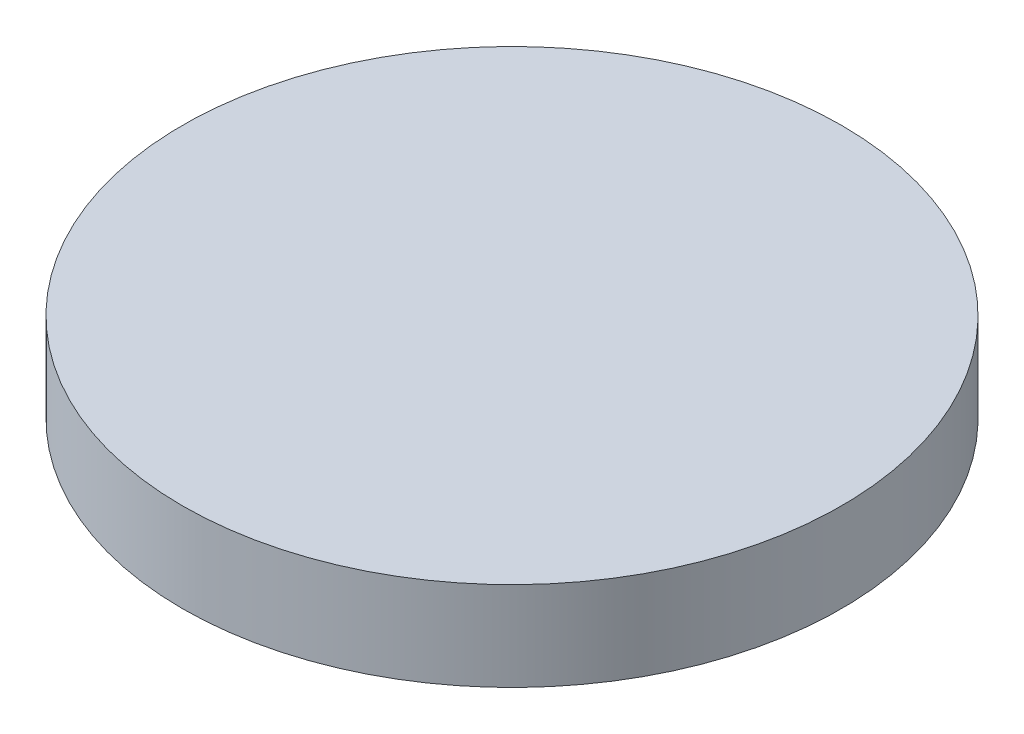
ISO-10303-21;
HEADER;
FILE_DESCRIPTION(('STEP AP214'),'2;1');
FILE_NAME('part.step','',(''),(''),'','','');
FILE_SCHEMA(('AUTOMOTIVE_DESIGN { 1 0 10303 214 1 1 1 1 }'));
ENDSEC;
DATA;
#1=APPLICATION_CONTEXT('core data for automotive mechanical design processes');
#2=APPLICATION_PROTOCOL_DEFINITION('international standard','automotive_design',2000,#1);
#3=PRODUCT_CONTEXT('',#1,'mechanical');
#4=PRODUCT('Part','Part','',(#3));
#5=PRODUCT_RELATED_PRODUCT_CATEGORY('part','',(#4));
#6=PRODUCT_DEFINITION_FORMATION('','',#4);
#7=PRODUCT_DEFINITION_CONTEXT('part definition',#1,'design');
#8=PRODUCT_DEFINITION('design','',#6,#7);
#9=PRODUCT_DEFINITION_SHAPE('','',#8);
#10=(LENGTH_UNIT() NAMED_UNIT(*) SI_UNIT(.MILLI.,.METRE.));
#11=(NAMED_UNIT(*) PLANE_ANGLE_UNIT() SI_UNIT($,.RADIAN.));
#12=(NAMED_UNIT(*) SI_UNIT($,.STERADIAN.) SOLID_ANGLE_UNIT());
#13=UNCERTAINTY_MEASURE_WITH_UNIT(LENGTH_MEASURE(1.E-05),#10,'distance_accuracy_value','');
#14=(GEOMETRIC_REPRESENTATION_CONTEXT(3) GLOBAL_UNCERTAINTY_ASSIGNED_CONTEXT((#13)) GLOBAL_UNIT_ASSIGNED_CONTEXT((#10,
#11,#12)) REPRESENTATION_CONTEXT('',''));
#15=CARTESIAN_POINT('',(0.,0.,0.));
#16=DIRECTION('',(0.,0.,1.));
#17=DIRECTION('',(1.,0.,0.));
#18=AXIS2_PLACEMENT_3D('',#15,#16,#17);
#19=CARTESIAN_POINT('',(-140.116350288167,10.,-35.1898143031804));
#20=DIRECTION('',(0.,-1.,0.));
#21=DIRECTION('',(0.,0.,-1.));
#22=AXIS2_PLACEMENT_3D('',#19,#20,#21);
#23=CYLINDRICAL_SURFACE('',#22,37.);
#24=CARTESIAN_POINT('',(-140.116350288167,10.,-35.1898143031804));
#25=DIRECTION('',(0.,1.,0.));
#26=DIRECTION('',(0.,0.,1.));
#27=AXIS2_PLACEMENT_3D('',#24,#25,#26);
#28=CIRCLE('',#27,37.);
#29=CARTESIAN_POINT('',(-140.116350288167,10.,1.81018569681966));
#30=VERTEX_POINT('',#29);
#31=EDGE_CURVE('E10',#30,#30,#28,.T.);
#32=ORIENTED_EDGE('',*,*,#31,.F.);
#33=EDGE_LOOP('',(#32));
#34=FACE_BOUND('',#33,.T.);
#35=CARTESIAN_POINT('',(-140.116350288167,0.,-35.1898143031804));
#36=DIRECTION('',(0.,1.,0.));
#37=DIRECTION('',(0.,0.,1.));
#38=AXIS2_PLACEMENT_3D('',#35,#36,#37);
#39=CIRCLE('',#38,37.);
#40=CARTESIAN_POINT('',(-140.116350288167,0.,1.81018569681966));
#41=VERTEX_POINT('',#40);
#42=EDGE_CURVE('E34',#41,#41,#39,.T.);
#43=ORIENTED_EDGE('',*,*,#42,.T.);
#44=EDGE_LOOP('',(#43));
#45=FACE_BOUND('',#44,.T.);
#46=ADVANCED_FACE('F31',(#34,#45),#23,.T.);
#47=CARTESIAN_POINT('',(-140.116350288167,10.,-35.1898143031804));
#48=DIRECTION('',(0.,1.,0.));
#49=DIRECTION('',(0.,0.,1.));
#50=AXIS2_PLACEMENT_3D('',#47,#48,#49);
#51=PLANE('',#50);
#52=ORIENTED_EDGE('',*,*,#31,.T.);
#53=EDGE_LOOP('',(#52));
#54=FACE_BOUND('',#53,.T.);
#55=ADVANCED_FACE('F46',(#54),#51,.T.);
#56=CARTESIAN_POINT('',(-140.116350288167,0.,-35.1898143031804));
#57=DIRECTION('',(0.,1.,0.));
#58=DIRECTION('',(0.,0.,1.));
#59=AXIS2_PLACEMENT_3D('',#56,#57,#58);
#60=PLANE('',#59);
#61=ORIENTED_EDGE('',*,*,#42,.F.);
#62=EDGE_LOOP('',(#61));
#63=FACE_BOUND('',#62,.T.);
#64=ADVANCED_FACE('F44',(#63),#60,.F.);
#65=CLOSED_SHELL('',(#46,#55,#64));
#66=MANIFOLD_SOLID_BREP('B2',#65);
#67=ADVANCED_BREP_SHAPE_REPRESENTATION('',(#18,#66),#14);
#68=SHAPE_DEFINITION_REPRESENTATION(#9,#67);
ENDSEC;
END-ISO-10303-21;
